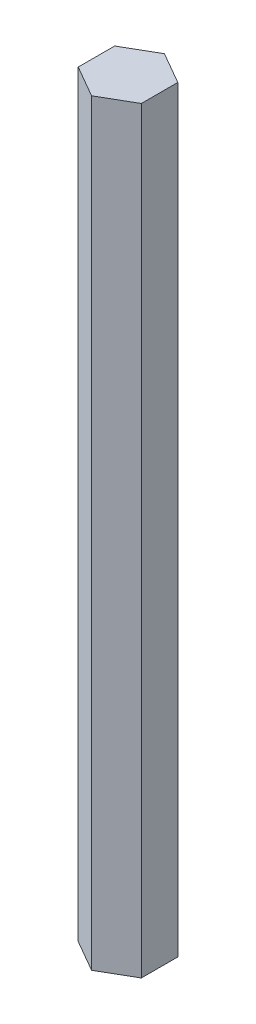
ISO-10303-21;
HEADER;
FILE_DESCRIPTION(('STEP AP214'),'2;1');
FILE_NAME('part.step','',(''),(''),'','','');
FILE_SCHEMA(('AUTOMOTIVE_DESIGN { 1 0 10303 214 1 1 1 1 }'));
ENDSEC;
DATA;
#1=APPLICATION_CONTEXT('core data for automotive mechanical design processes');
#2=APPLICATION_PROTOCOL_DEFINITION('international standard','automotive_design',2000,#1);
#3=PRODUCT_CONTEXT('',#1,'mechanical');
#4=PRODUCT('Part','Part','',(#3));
#5=PRODUCT_RELATED_PRODUCT_CATEGORY('part','',(#4));
#6=PRODUCT_DEFINITION_FORMATION('','',#4);
#7=PRODUCT_DEFINITION_CONTEXT('part definition',#1,'design');
#8=PRODUCT_DEFINITION('design','',#6,#7);
#9=PRODUCT_DEFINITION_SHAPE('','',#8);
#10=(LENGTH_UNIT() NAMED_UNIT(*) SI_UNIT(.MILLI.,.METRE.));
#11=(NAMED_UNIT(*) PLANE_ANGLE_UNIT() SI_UNIT($,.RADIAN.));
#12=(NAMED_UNIT(*) SI_UNIT($,.STERADIAN.) SOLID_ANGLE_UNIT());
#13=UNCERTAINTY_MEASURE_WITH_UNIT(LENGTH_MEASURE(1.E-05),#10,'distance_accuracy_value','');
#14=(GEOMETRIC_REPRESENTATION_CONTEXT(3) GLOBAL_UNCERTAINTY_ASSIGNED_CONTEXT((#13)) GLOBAL_UNIT_ASSIGNED_CONTEXT((#10,
#11,#12)) REPRESENTATION_CONTEXT('',''));
#15=CARTESIAN_POINT('',(0.,0.,0.));
#16=DIRECTION('',(0.,0.,1.));
#17=DIRECTION('',(1.,0.,0.));
#18=AXIS2_PLACEMENT_3D('',#15,#16,#17);
#19=CARTESIAN_POINT('',(4.99999999999996,120.,-2.88675134594818));
#20=DIRECTION('',(-0.499999999999995,0.,0.866025403784441));
#21=DIRECTION('',(0.866025403784442,0.,0.499999999999995));
#22=AXIS2_PLACEMENT_3D('',#19,#20,#21);
#23=PLANE('',#22);
#24=DIRECTION('',(-0.866025403784441,0.,-0.499999999999995));
#25=VECTOR('',#24,1.);
#26=CARTESIAN_POINT('',(4.99999999999996,0.,-2.88675134594818));
#27=LINE('',#26,#25);
#28=CARTESIAN_POINT('',(4.99999999999996,0.,-2.88675134594818));
#29=VERTEX_POINT('',#28);
#30=CARTESIAN_POINT('',(0.,0.,-5.77350269189625));
#31=VERTEX_POINT('',#30);
#32=EDGE_CURVE('E116',#29,#31,#27,.T.);
#33=ORIENTED_EDGE('',*,*,#32,.T.);
#34=DIRECTION('',(0.,-1.,0.));
#35=VECTOR('',#34,1.);
#36=CARTESIAN_POINT('',(0.,120.,-5.77350269189625));
#37=LINE('',#36,#35);
#38=CARTESIAN_POINT('',(0.,120.,-5.77350269189625));
#39=VERTEX_POINT('',#38);
#40=EDGE_CURVE('E11',#39,#31,#37,.T.);
#41=ORIENTED_EDGE('',*,*,#40,.F.);
#42=DIRECTION('',(-0.866025403784441,0.,-0.499999999999995));
#43=VECTOR('',#42,1.);
#44=CARTESIAN_POINT('',(4.99999999999996,120.,-2.88675134594818));
#45=LINE('',#44,#43);
#46=CARTESIAN_POINT('',(4.99999999999996,120.,-2.88675134594818));
#47=VERTEX_POINT('',#46);
#48=EDGE_CURVE('E127',#47,#39,#45,.T.);
#49=ORIENTED_EDGE('',*,*,#48,.F.);
#50=DIRECTION('',(0.,-1.,0.));
#51=VECTOR('',#50,1.);
#52=CARTESIAN_POINT('',(4.99999999999996,120.,-2.88675134594818));
#53=LINE('',#52,#51);
#54=EDGE_CURVE('E112',#47,#29,#53,.T.);
#55=ORIENTED_EDGE('',*,*,#54,.T.);
#56=EDGE_LOOP('',(#33,#41,#49,#55));
#57=FACE_BOUND('',#56,.T.);
#58=ADVANCED_FACE('F32',(#57),#23,.F.);
#59=CARTESIAN_POINT('',(0.,120.,-5.77350269189625));
#60=DIRECTION('',(0.500000000000001,0.,0.866025403784438));
#61=DIRECTION('',(0.866025403784438,0.,-0.500000000000001));
#62=AXIS2_PLACEMENT_3D('',#59,#60,#61);
#63=PLANE('',#62);
#64=DIRECTION('',(-0.866025403784438,0.,0.500000000000001));
#65=VECTOR('',#64,1.);
#66=CARTESIAN_POINT('',(0.,0.,-5.77350269189625));
#67=LINE('',#66,#65);
#68=CARTESIAN_POINT('',(-5.,0.,-2.88675134594811));
#69=VERTEX_POINT('',#68);
#70=EDGE_CURVE('E119',#31,#69,#67,.T.);
#71=ORIENTED_EDGE('',*,*,#70,.T.);
#72=DIRECTION('',(0.,-1.,0.));
#73=VECTOR('',#72,1.);
#74=CARTESIAN_POINT('',(-5.,120.,-2.88675134594811));
#75=LINE('',#74,#73);
#76=CARTESIAN_POINT('',(-5.,120.,-2.88675134594811));
#77=VERTEX_POINT('',#76);
#78=EDGE_CURVE('E40',#77,#69,#75,.T.);
#79=ORIENTED_EDGE('',*,*,#78,.F.);
#80=DIRECTION('',(-0.866025403784438,0.,0.500000000000001));
#81=VECTOR('',#80,1.);
#82=CARTESIAN_POINT('',(0.,120.,-5.77350269189625));
#83=LINE('',#82,#81);
#84=EDGE_CURVE('E85',#39,#77,#83,.T.);
#85=ORIENTED_EDGE('',*,*,#84,.F.);
#86=ORIENTED_EDGE('',*,*,#40,.T.);
#87=EDGE_LOOP('',(#71,#79,#85,#86));
#88=FACE_BOUND('',#87,.T.);
#89=ADVANCED_FACE('F151',(#88),#63,.F.);
#90=CARTESIAN_POINT('',(-5.,120.,-2.88675134594811));
#91=DIRECTION('',(1.,0.,0.));
#92=DIRECTION('',(0.,0.,-1.));
#93=AXIS2_PLACEMENT_3D('',#90,#91,#92);
#94=PLANE('',#93);
#95=DIRECTION('',(0.,0.,1.));
#96=VECTOR('',#95,1.);
#97=CARTESIAN_POINT('',(-5.,0.,-2.88675134594811));
#98=LINE('',#97,#96);
#99=CARTESIAN_POINT('',(-4.99999999999998,0.,2.88675134594815));
#100=VERTEX_POINT('',#99);
#101=EDGE_CURVE('E122',#69,#100,#98,.T.);
#102=ORIENTED_EDGE('',*,*,#101,.T.);
#103=DIRECTION('',(0.,-1.,0.));
#104=VECTOR('',#103,1.);
#105=CARTESIAN_POINT('',(-4.99999999999998,120.,2.88675134594815));
#106=LINE('',#105,#104);
#107=CARTESIAN_POINT('',(-4.99999999999998,120.,2.88675134594815));
#108=VERTEX_POINT('',#107);
#109=EDGE_CURVE('E107',#108,#100,#106,.T.);
#110=ORIENTED_EDGE('',*,*,#109,.F.);
#111=DIRECTION('',(0.,0.,1.));
#112=VECTOR('',#111,1.);
#113=CARTESIAN_POINT('',(-5.,120.,-2.88675134594811));
#114=LINE('',#113,#112);
#115=EDGE_CURVE('E98',#77,#108,#114,.T.);
#116=ORIENTED_EDGE('',*,*,#115,.F.);
#117=ORIENTED_EDGE('',*,*,#78,.T.);
#118=EDGE_LOOP('',(#102,#110,#116,#117));
#119=FACE_BOUND('',#118,.T.);
#120=ADVANCED_FACE('F133',(#119),#94,.F.);
#121=CARTESIAN_POINT('',(-4.99999999999998,120.,2.88675134594815));
#122=DIRECTION('',(0.499999999999995,0.,-0.866025403784441));
#123=DIRECTION('',(-0.866025403784441,0.,-0.499999999999995));
#124=AXIS2_PLACEMENT_3D('',#121,#122,#123);
#125=PLANE('',#124);
#126=DIRECTION('',(0.866025403784441,0.,0.499999999999995));
#127=VECTOR('',#126,1.);
#128=CARTESIAN_POINT('',(-4.99999999999998,0.,2.88675134594815));
#129=LINE('',#128,#127);
#130=CARTESIAN_POINT('',(0.,0.,5.77350269189625));
#131=VERTEX_POINT('',#130);
#132=EDGE_CURVE('E106',#100,#131,#129,.T.);
#133=ORIENTED_EDGE('',*,*,#132,.T.);
#134=DIRECTION('',(0.,-1.,0.));
#135=VECTOR('',#134,1.);
#136=CARTESIAN_POINT('',(0.,120.,5.77350269189625));
#137=LINE('',#136,#135);
#138=CARTESIAN_POINT('',(0.,120.,5.77350269189625));
#139=VERTEX_POINT('',#138);
#140=EDGE_CURVE('E103',#139,#131,#137,.T.);
#141=ORIENTED_EDGE('',*,*,#140,.F.);
#142=DIRECTION('',(0.866025403784441,0.,0.499999999999995));
#143=VECTOR('',#142,1.);
#144=CARTESIAN_POINT('',(-4.99999999999998,120.,2.88675134594815));
#145=LINE('',#144,#143);
#146=EDGE_CURVE('E92',#108,#139,#145,.T.);
#147=ORIENTED_EDGE('',*,*,#146,.F.);
#148=ORIENTED_EDGE('',*,*,#109,.T.);
#149=EDGE_LOOP('',(#133,#141,#147,#148));
#150=FACE_BOUND('',#149,.T.);
#151=ADVANCED_FACE('F104',(#150),#125,.F.);
#152=CARTESIAN_POINT('',(0.,120.,5.77350269189625));
#153=DIRECTION('',(-0.500000000000007,0.,-0.866025403784435));
#154=DIRECTION('',(-0.866025403784435,0.,0.500000000000007));
#155=AXIS2_PLACEMENT_3D('',#152,#153,#154);
#156=PLANE('',#155);
#157=DIRECTION('',(0.866025403784435,0.,-0.500000000000007));
#158=VECTOR('',#157,1.);
#159=CARTESIAN_POINT('',(0.,0.,5.77350269189625));
#160=LINE('',#159,#158);
#161=CARTESIAN_POINT('',(5.00000000000002,0.,2.88675134594808));
#162=VERTEX_POINT('',#161);
#163=EDGE_CURVE('E71',#131,#162,#160,.T.);
#164=ORIENTED_EDGE('',*,*,#163,.T.);
#165=DIRECTION('',(0.,-1.,0.));
#166=VECTOR('',#165,1.);
#167=CARTESIAN_POINT('',(5.00000000000002,120.,2.88675134594808));
#168=LINE('',#167,#166);
#169=CARTESIAN_POINT('',(5.00000000000002,120.,2.88675134594808));
#170=VERTEX_POINT('',#169);
#171=EDGE_CURVE('E108',#170,#162,#168,.T.);
#172=ORIENTED_EDGE('',*,*,#171,.F.);
#173=DIRECTION('',(0.866025403784435,0.,-0.500000000000007));
#174=VECTOR('',#173,1.);
#175=CARTESIAN_POINT('',(0.,120.,5.77350269189625));
#176=LINE('',#175,#174);
#177=EDGE_CURVE('E96',#139,#170,#176,.T.);
#178=ORIENTED_EDGE('',*,*,#177,.F.);
#179=ORIENTED_EDGE('',*,*,#140,.T.);
#180=EDGE_LOOP('',(#164,#172,#178,#179));
#181=FACE_BOUND('',#180,.T.);
#182=ADVANCED_FACE('F110',(#181),#156,.F.);
#183=CARTESIAN_POINT('',(5.00000000000002,120.,2.88675134594808));
#184=DIRECTION('',(-1.,0.,0.));
#185=DIRECTION('',(0.,0.,1.));
#186=AXIS2_PLACEMENT_3D('',#183,#184,#185);
#187=PLANE('',#186);
#188=DIRECTION('',(0.,0.,-1.));
#189=VECTOR('',#188,1.);
#190=CARTESIAN_POINT('',(5.00000000000002,0.,2.88675134594808));
#191=LINE('',#190,#189);
#192=EDGE_CURVE('E77',#162,#29,#191,.T.);
#193=ORIENTED_EDGE('',*,*,#192,.T.);
#194=ORIENTED_EDGE('',*,*,#54,.F.);
#195=DIRECTION('',(0.,0.,-1.));
#196=VECTOR('',#195,1.);
#197=CARTESIAN_POINT('',(5.00000000000002,120.,2.88675134594808));
#198=LINE('',#197,#196);
#199=EDGE_CURVE('E48',#170,#47,#198,.T.);
#200=ORIENTED_EDGE('',*,*,#199,.F.);
#201=ORIENTED_EDGE('',*,*,#171,.T.);
#202=EDGE_LOOP('',(#193,#194,#200,#201));
#203=FACE_BOUND('',#202,.T.);
#204=ADVANCED_FACE('F140',(#203),#187,.F.);
#205=CARTESIAN_POINT('',(0.,120.,0.));
#206=DIRECTION('',(0.,1.,0.));
#207=DIRECTION('',(0.,0.,1.));
#208=AXIS2_PLACEMENT_3D('',#205,#206,#207);
#209=PLANE('',#208);
#210=ORIENTED_EDGE('',*,*,#48,.T.);
#211=ORIENTED_EDGE('',*,*,#84,.T.);
#212=ORIENTED_EDGE('',*,*,#115,.T.);
#213=ORIENTED_EDGE('',*,*,#146,.T.);
#214=ORIENTED_EDGE('',*,*,#177,.T.);
#215=ORIENTED_EDGE('',*,*,#199,.T.);
#216=EDGE_LOOP('',(#210,#211,#212,#213,#214,#215));
#217=FACE_BOUND('',#216,.T.);
#218=ADVANCED_FACE('F94',(#217),#209,.T.);
#219=CARTESIAN_POINT('',(0.,0.,0.));
#220=DIRECTION('',(0.,1.,0.));
#221=DIRECTION('',(0.,0.,1.));
#222=AXIS2_PLACEMENT_3D('',#219,#220,#221);
#223=PLANE('',#222);
#224=CARTESIAN_POINT('',(0.,0.,0.));
#225=DIRECTION('',(0.,-1.,0.));
#226=DIRECTION('',(0.,0.,-1.));
#227=AXIS2_PLACEMENT_3D('',#224,#225,#226);
#228=CIRCLE('',#227,3.);
#229=CARTESIAN_POINT('',(0.,0.,-3.));
#230=VERTEX_POINT('',#229);
#231=EDGE_CURVE('E213',#230,#230,#228,.T.);
#232=ORIENTED_EDGE('',*,*,#231,.F.);
#233=EDGE_LOOP('',(#232));
#234=FACE_BOUND('',#233,.T.);
#235=ORIENTED_EDGE('',*,*,#32,.F.);
#236=ORIENTED_EDGE('',*,*,#192,.F.);
#237=ORIENTED_EDGE('',*,*,#163,.F.);
#238=ORIENTED_EDGE('',*,*,#132,.F.);
#239=ORIENTED_EDGE('',*,*,#101,.F.);
#240=ORIENTED_EDGE('',*,*,#70,.F.);
#241=EDGE_LOOP('',(#235,#236,#237,#238,#239,#240));
#242=FACE_BOUND('',#241,.T.);
#243=ADVANCED_FACE('F136',(#234,#242),#223,.F.);
#244=CARTESIAN_POINT('',(0.,5.,0.));
#245=DIRECTION('',(0.,-1.,0.));
#246=DIRECTION('',(0.,0.,-1.));
#247=AXIS2_PLACEMENT_3D('',#244,#245,#246);
#248=CYLINDRICAL_SURFACE('',#247,3.);
#249=CARTESIAN_POINT('',(0.,5.,0.));
#250=DIRECTION('',(0.,-1.,0.));
#251=DIRECTION('',(0.,0.,-1.));
#252=AXIS2_PLACEMENT_3D('',#249,#250,#251);
#253=CIRCLE('',#252,3.);
#254=CARTESIAN_POINT('',(0.,5.,-3.));
#255=VERTEX_POINT('',#254);
#256=EDGE_CURVE('E120',#255,#255,#253,.T.);
#257=ORIENTED_EDGE('',*,*,#256,.F.);
#258=EDGE_LOOP('',(#257));
#259=FACE_BOUND('',#258,.T.);
#260=ORIENTED_EDGE('',*,*,#231,.T.);
#261=EDGE_LOOP('',(#260));
#262=FACE_BOUND('',#261,.T.);
#263=ADVANCED_FACE('F188',(#259,#262),#248,.F.);
#264=CARTESIAN_POINT('',(0.,5.,0.));
#265=DIRECTION('',(0.,-1.,0.));
#266=DIRECTION('',(0.,0.,-1.));
#267=AXIS2_PLACEMENT_3D('',#264,#265,#266);
#268=PLANE('',#267);
#269=ORIENTED_EDGE('',*,*,#256,.T.);
#270=EDGE_LOOP('',(#269));
#271=FACE_BOUND('',#270,.T.);
#272=ADVANCED_FACE('F197',(#271),#268,.T.);
#273=CLOSED_SHELL('',(#58,#89,#120,#151,#182,#204,#218,#243,#263,#272));
#274=MANIFOLD_SOLID_BREP('B2',#273);
#275=ADVANCED_BREP_SHAPE_REPRESENTATION('',(#18,#274),#14);
#276=SHAPE_DEFINITION_REPRESENTATION(#9,#275);
ENDSEC;
END-ISO-10303-21;
